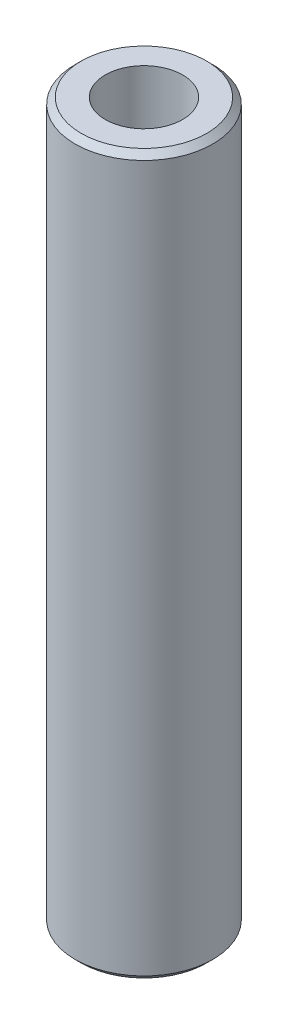
ISO-10303-21;
HEADER;
FILE_DESCRIPTION(('STEP AP214'),'2;1');
FILE_NAME('part.step','',(''),(''),'','','');
FILE_SCHEMA(('AUTOMOTIVE_DESIGN { 1 0 10303 214 1 1 1 1 }'));
ENDSEC;
DATA;
#1=APPLICATION_CONTEXT('core data for automotive mechanical design processes');
#2=APPLICATION_PROTOCOL_DEFINITION('international standard','automotive_design',2000,#1);
#3=PRODUCT_CONTEXT('',#1,'mechanical');
#4=PRODUCT('Part','Part','',(#3));
#5=PRODUCT_RELATED_PRODUCT_CATEGORY('part','',(#4));
#6=PRODUCT_DEFINITION_FORMATION('','',#4);
#7=PRODUCT_DEFINITION_CONTEXT('part definition',#1,'design');
#8=PRODUCT_DEFINITION('design','',#6,#7);
#9=PRODUCT_DEFINITION_SHAPE('','',#8);
#10=(LENGTH_UNIT() NAMED_UNIT(*) SI_UNIT(.MILLI.,.METRE.));
#11=(NAMED_UNIT(*) PLANE_ANGLE_UNIT() SI_UNIT($,.RADIAN.));
#12=(NAMED_UNIT(*) SI_UNIT($,.STERADIAN.) SOLID_ANGLE_UNIT());
#13=UNCERTAINTY_MEASURE_WITH_UNIT(LENGTH_MEASURE(1.E-05),#10,'distance_accuracy_value','');
#14=(GEOMETRIC_REPRESENTATION_CONTEXT(3) GLOBAL_UNCERTAINTY_ASSIGNED_CONTEXT((#13)) GLOBAL_UNIT_ASSIGNED_CONTEXT((#10,
#11,#12)) REPRESENTATION_CONTEXT('',''));
#15=CARTESIAN_POINT('',(0.,0.,0.));
#16=DIRECTION('',(0.,0.,1.));
#17=DIRECTION('',(1.,0.,0.));
#18=AXIS2_PLACEMENT_3D('',#15,#16,#17);
#19=CARTESIAN_POINT('',(0.,600.,0.));
#20=DIRECTION('',(0.,-1.,0.));
#21=DIRECTION('',(0.,0.,-1.));
#22=AXIS2_PLACEMENT_3D('',#19,#20,#21);
#23=CYLINDRICAL_SURFACE('',#22,57.5);
#24=CARTESIAN_POINT('',(0.,594.886400280718,0.));
#25=DIRECTION('',(0.,1.,0.));
#26=DIRECTION('',(0.,0.,1.));
#27=AXIS2_PLACEMENT_3D('',#24,#25,#26);
#28=CIRCLE('',#27,57.5);
#29=CARTESIAN_POINT('',(0.,594.886400280718,57.5));
#30=VERTEX_POINT('',#29);
#31=EDGE_CURVE('E50',#30,#30,#28,.F.);
#32=ORIENTED_EDGE('',*,*,#31,.T.);
#33=EDGE_LOOP('',(#32));
#34=FACE_BOUND('',#33,.T.);
#35=CARTESIAN_POINT('',(0.,5.11359971928205,0.));
#36=DIRECTION('',(0.,1.,0.));
#37=DIRECTION('',(0.,0.,1.));
#38=AXIS2_PLACEMENT_3D('',#35,#36,#37);
#39=CIRCLE('',#38,57.5);
#40=CARTESIAN_POINT('',(0.,5.11359971928205,57.5));
#41=VERTEX_POINT('',#40);
#42=EDGE_CURVE('E51',#41,#41,#39,.T.);
#43=ORIENTED_EDGE('',*,*,#42,.T.);
#44=EDGE_LOOP('',(#43));
#45=FACE_BOUND('',#44,.T.);
#46=ADVANCED_FACE('F39',(#34,#45),#23,.T.);
#47=CARTESIAN_POINT('',(0.,600.,0.));
#48=DIRECTION('',(0.,1.,0.));
#49=DIRECTION('',(0.,0.,1.));
#50=AXIS2_PLACEMENT_3D('',#47,#48,#49);
#51=PLANE('',#50);
#52=CARTESIAN_POINT('',(0.,600.,0.));
#53=DIRECTION('',(0.,1.,0.));
#54=DIRECTION('',(0.,0.,1.));
#55=AXIS2_PLACEMENT_3D('',#52,#53,#54);
#56=CIRCLE('',#55,52.386400280718);
#57=CARTESIAN_POINT('',(0.,600.,52.386400280718));
#58=VERTEX_POINT('',#57);
#59=EDGE_CURVE('E54',#58,#58,#56,.T.);
#60=ORIENTED_EDGE('',*,*,#59,.T.);
#61=EDGE_LOOP('',(#60));
#62=FACE_BOUND('',#61,.T.);
#63=CARTESIAN_POINT('',(0.,600.,0.));
#64=DIRECTION('',(0.,1.,0.));
#65=DIRECTION('',(0.,0.,1.));
#66=AXIS2_PLACEMENT_3D('',#63,#64,#65);
#67=CIRCLE('',#66,32.3205422171609);
#68=CARTESIAN_POINT('',(0.,600.,32.3205422171609));
#69=VERTEX_POINT('',#68);
#70=EDGE_CURVE('E58',#69,#69,#67,.T.);
#71=ORIENTED_EDGE('',*,*,#70,.F.);
#72=EDGE_LOOP('',(#71));
#73=FACE_BOUND('',#72,.T.);
#74=ADVANCED_FACE('F69',(#62,#73),#51,.T.);
#75=CARTESIAN_POINT('',(0.,0.,0.));
#76=DIRECTION('',(0.,1.,0.));
#77=DIRECTION('',(0.,0.,1.));
#78=AXIS2_PLACEMENT_3D('',#75,#76,#77);
#79=PLANE('',#78);
#80=CARTESIAN_POINT('',(0.,0.,0.));
#81=DIRECTION('',(0.,1.,0.));
#82=DIRECTION('',(0.,0.,1.));
#83=AXIS2_PLACEMENT_3D('',#80,#81,#82);
#84=CIRCLE('',#83,52.386400280718);
#85=CARTESIAN_POINT('',(0.,0.,52.386400280718));
#86=VERTEX_POINT('',#85);
#87=EDGE_CURVE('E10',#86,#86,#84,.F.);
#88=ORIENTED_EDGE('',*,*,#87,.T.);
#89=EDGE_LOOP('',(#88));
#90=FACE_BOUND('',#89,.T.);
#91=CARTESIAN_POINT('',(0.,0.,0.));
#92=DIRECTION('',(0.,1.,0.));
#93=DIRECTION('',(0.,0.,1.));
#94=AXIS2_PLACEMENT_3D('',#91,#92,#93);
#95=CIRCLE('',#94,32.3205422171609);
#96=CARTESIAN_POINT('',(0.,0.,32.3205422171609));
#97=VERTEX_POINT('',#96);
#98=EDGE_CURVE('E63',#97,#97,#95,.T.);
#99=ORIENTED_EDGE('',*,*,#98,.T.);
#100=EDGE_LOOP('',(#99));
#101=FACE_BOUND('',#100,.T.);
#102=ADVANCED_FACE('F75',(#90,#101),#79,.F.);
#103=CARTESIAN_POINT('',(0.,600.,0.));
#104=DIRECTION('',(0.,-1.,0.));
#105=DIRECTION('',(0.,0.,-1.));
#106=AXIS2_PLACEMENT_3D('',#103,#104,#105);
#107=CYLINDRICAL_SURFACE('',#106,32.3205422171609);
#108=ORIENTED_EDGE('',*,*,#70,.T.);
#109=EDGE_LOOP('',(#108));
#110=FACE_BOUND('',#109,.T.);
#111=ORIENTED_EDGE('',*,*,#98,.F.);
#112=EDGE_LOOP('',(#111));
#113=FACE_BOUND('',#112,.T.);
#114=ADVANCED_FACE('F70',(#110,#113),#107,.F.);
#115=CARTESIAN_POINT('',(0.,600.,0.));
#116=DIRECTION('',(0.,-1.,0.));
#117=DIRECTION('',(0.,0.,-1.));
#118=AXIS2_PLACEMENT_3D('',#115,#116,#117);
#119=CONICAL_SURFACE('',#118,52.386400280718,0.785398163397455);
#120=ORIENTED_EDGE('',*,*,#31,.F.);
#121=EDGE_LOOP('',(#120));
#122=FACE_BOUND('',#121,.T.);
#123=ORIENTED_EDGE('',*,*,#59,.F.);
#124=EDGE_LOOP('',(#123));
#125=FACE_BOUND('',#124,.T.);
#126=ADVANCED_FACE('F81',(#122,#125),#119,.T.);
#127=CARTESIAN_POINT('',(0.,5.11359971928205,0.));
#128=DIRECTION('',(0.,1.,0.));
#129=DIRECTION('',(0.,0.,1.));
#130=AXIS2_PLACEMENT_3D('',#127,#128,#129);
#131=CONICAL_SURFACE('',#130,57.5,0.785398163397448);
#132=ORIENTED_EDGE('',*,*,#87,.F.);
#133=EDGE_LOOP('',(#132));
#134=FACE_BOUND('',#133,.T.);
#135=ORIENTED_EDGE('',*,*,#42,.F.);
#136=EDGE_LOOP('',(#135));
#137=FACE_BOUND('',#136,.T.);
#138=ADVANCED_FACE('F45',(#134,#137),#131,.T.);
#139=CLOSED_SHELL('',(#46,#74,#102,#114,#126,#138));
#140=MANIFOLD_SOLID_BREP('B2',#139);
#141=ADVANCED_BREP_SHAPE_REPRESENTATION('',(#18,#140),#14);
#142=SHAPE_DEFINITION_REPRESENTATION(#9,#141);
ENDSEC;
END-ISO-10303-21;
